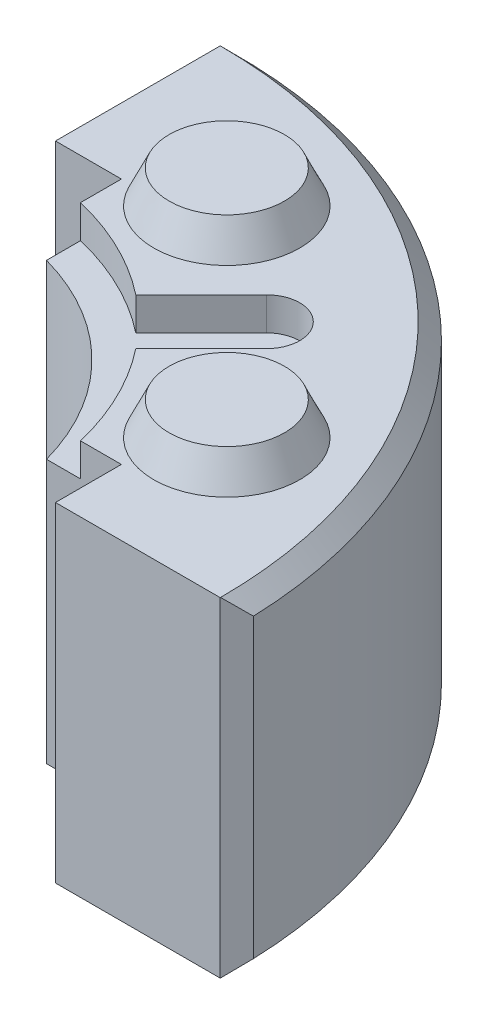
ISO-10303-21;
HEADER;
FILE_DESCRIPTION(('STEP AP214'),'2;1');
FILE_NAME('part.step','',(''),(''),'','','');
FILE_SCHEMA(('AUTOMOTIVE_DESIGN { 1 0 10303 214 1 1 1 1 }'));
ENDSEC;
DATA;
#1=APPLICATION_CONTEXT('core data for automotive mechanical design processes');
#2=APPLICATION_PROTOCOL_DEFINITION('international standard','automotive_design',2000,#1);
#3=PRODUCT_CONTEXT('',#1,'mechanical');
#4=PRODUCT('Part','Part','',(#3));
#5=PRODUCT_RELATED_PRODUCT_CATEGORY('part','',(#4));
#6=PRODUCT_DEFINITION_FORMATION('','',#4);
#7=PRODUCT_DEFINITION_CONTEXT('part definition',#1,'design');
#8=PRODUCT_DEFINITION('design','',#6,#7);
#9=PRODUCT_DEFINITION_SHAPE('','',#8);
#10=(LENGTH_UNIT() NAMED_UNIT(*) SI_UNIT(.MILLI.,.METRE.));
#11=(NAMED_UNIT(*) PLANE_ANGLE_UNIT() SI_UNIT($,.RADIAN.));
#12=(NAMED_UNIT(*) SI_UNIT($,.STERADIAN.) SOLID_ANGLE_UNIT());
#13=UNCERTAINTY_MEASURE_WITH_UNIT(LENGTH_MEASURE(1.E-05),#10,'distance_accuracy_value','');
#14=(GEOMETRIC_REPRESENTATION_CONTEXT(3) GLOBAL_UNCERTAINTY_ASSIGNED_CONTEXT((#13)) GLOBAL_UNIT_ASSIGNED_CONTEXT((#10,
#11,#12)) REPRESENTATION_CONTEXT('',''));
#15=CARTESIAN_POINT('',(0.,0.,0.));
#16=DIRECTION('',(0.,0.,1.));
#17=DIRECTION('',(1.,0.,0.));
#18=AXIS2_PLACEMENT_3D('',#15,#16,#17);
#19=CARTESIAN_POINT('',(0.,10.,0.));
#20=DIRECTION('',(0.,-1.,0.));
#21=DIRECTION('',(0.,0.,-1.));
#22=AXIS2_PLACEMENT_3D('',#19,#20,#21);
#23=CYLINDRICAL_SURFACE('',#22,85.);
#24=CARTESIAN_POINT('',(0.,10.,0.));
#25=DIRECTION('',(0.,-1.,0.));
#26=DIRECTION('',(0.,0.,-1.));
#27=AXIS2_PLACEMENT_3D('',#24,#25,#26);
#28=CIRCLE('',#27,85.);
#29=CARTESIAN_POINT('',(66.7577497434309,10.,-52.6156141197026));
#30=VERTEX_POINT('',#29);
#31=CARTESIAN_POINT('',(82.6135582092915,10.,-20.0000000000003));
#32=VERTEX_POINT('',#31);
#33=EDGE_CURVE('E222',#30,#32,#28,.T.);
#34=ORIENTED_EDGE('',*,*,#33,.F.);
#35=DIRECTION('',(0.,-1.,0.));
#36=VECTOR('',#35,1.);
#37=CARTESIAN_POINT('',(66.7577497434309,10.,-52.6156141197026));
#38=LINE('',#37,#36);
#39=CARTESIAN_POINT('',(66.7577497434309,0.,-52.6156141197026));
#40=VERTEX_POINT('',#39);
#41=EDGE_CURVE('E712',#30,#40,#38,.T.);
#42=ORIENTED_EDGE('',*,*,#41,.T.);
#43=CARTESIAN_POINT('',(0.,0.,0.));
#44=DIRECTION('',(0.,-1.,0.));
#45=DIRECTION('',(0.,0.,-1.));
#46=AXIS2_PLACEMENT_3D('',#43,#44,#45);
#47=CIRCLE('',#46,85.);
#48=CARTESIAN_POINT('',(82.6135582092915,0.,-20.0000000000003));
#49=VERTEX_POINT('',#48);
#50=EDGE_CURVE('E230',#40,#49,#47,.T.);
#51=ORIENTED_EDGE('',*,*,#50,.T.);
#52=DIRECTION('',(0.,-1.,0.));
#53=VECTOR('',#52,1.);
#54=CARTESIAN_POINT('',(82.6135582092915,10.,-20.0000000000003));
#55=LINE('',#54,#53);
#56=EDGE_CURVE('E233',#32,#49,#55,.T.);
#57=ORIENTED_EDGE('',*,*,#56,.F.);
#58=EDGE_LOOP('',(#34,#42,#51,#57));
#59=FACE_BOUND('',#58,.T.);
#60=ADVANCED_FACE('F35',(#59),#23,.F.);
#61=CARTESIAN_POINT('',(0.,90.,0.));
#62=DIRECTION('',(0.,1.,0.));
#63=DIRECTION('',(0.,0.,1.));
#64=AXIS2_PLACEMENT_3D('',#61,#62,#63);
#65=CYLINDRICAL_SURFACE('',#64,85.);
#66=CARTESIAN_POINT('',(0.,100.,0.));
#67=DIRECTION('',(0.,1.,0.));
#68=DIRECTION('',(0.,0.,1.));
#69=AXIS2_PLACEMENT_3D('',#66,#67,#68);
#70=CIRCLE('',#69,85.);
#71=CARTESIAN_POINT('',(82.6135582092915,100.,-20.0000000000003));
#72=VERTEX_POINT('',#71);
#73=CARTESIAN_POINT('',(66.7577497434309,100.,-52.6156141197026));
#74=VERTEX_POINT('',#73);
#75=EDGE_CURVE('E242',#72,#74,#70,.T.);
#76=ORIENTED_EDGE('',*,*,#75,.T.);
#77=DIRECTION('',(0.,1.,0.));
#78=VECTOR('',#77,1.);
#79=CARTESIAN_POINT('',(66.7577497434309,90.,-52.6156141197026));
#80=LINE('',#79,#78);
#81=CARTESIAN_POINT('',(66.7577497434309,90.,-52.6156141197026));
#82=VERTEX_POINT('',#81);
#83=EDGE_CURVE('E732',#82,#74,#80,.T.);
#84=ORIENTED_EDGE('',*,*,#83,.F.);
#85=CARTESIAN_POINT('',(0.,90.,0.));
#86=DIRECTION('',(0.,1.,0.));
#87=DIRECTION('',(0.,0.,1.));
#88=AXIS2_PLACEMENT_3D('',#85,#86,#87);
#89=CIRCLE('',#88,85.);
#90=CARTESIAN_POINT('',(82.6135582092915,90.,-20.0000000000003));
#91=VERTEX_POINT('',#90);
#92=EDGE_CURVE('E237',#91,#82,#89,.T.);
#93=ORIENTED_EDGE('',*,*,#92,.F.);
#94=DIRECTION('',(0.,1.,0.));
#95=VECTOR('',#94,1.);
#96=CARTESIAN_POINT('',(82.6135582092915,90.,-20.0000000000003));
#97=LINE('',#96,#95);
#98=EDGE_CURVE('E249',#72,#91,#97,.F.);
#99=ORIENTED_EDGE('',*,*,#98,.F.);
#100=EDGE_LOOP('',(#76,#84,#93,#99));
#101=FACE_BOUND('',#100,.T.);
#102=ADVANCED_FACE('F462',(#101),#65,.F.);
#103=CARTESIAN_POINT('',(0.,100.,0.));
#104=DIRECTION('',(0.,-1.,0.));
#105=DIRECTION('',(0.,0.,-1.));
#106=AXIS2_PLACEMENT_3D('',#103,#104,#105);
#107=CYLINDRICAL_SURFACE('',#106,75.);
#108=CARTESIAN_POINT('',(0.,9.99999999999999,0.));
#109=DIRECTION('',(0.,-1.,0.));
#110=DIRECTION('',(0.,0.,-1.));
#111=AXIS2_PLACEMENT_3D('',#108,#109,#110);
#112=CIRCLE('',#111,75.);
#113=CARTESIAN_POINT('',(72.2841614740047,9.99999999999999,-20.0000000000002));
#114=VERTEX_POINT('',#113);
#115=CARTESIAN_POINT('',(20.,10.,-72.2841614740048));
#116=VERTEX_POINT('',#115);
#117=EDGE_CURVE('E221',#114,#116,#112,.F.);
#118=ORIENTED_EDGE('',*,*,#117,.F.);
#119=DIRECTION('',(0.,-1.,0.));
#120=VECTOR('',#119,1.);
#121=CARTESIAN_POINT('',(72.2841614740047,100.,-20.0000000000002));
#122=LINE('',#121,#120);
#123=CARTESIAN_POINT('',(72.2841614740047,90.,-20.0000000000002));
#124=VERTEX_POINT('',#123);
#125=EDGE_CURVE('E266',#114,#124,#122,.F.);
#126=ORIENTED_EDGE('',*,*,#125,.T.);
#127=CARTESIAN_POINT('',(0.,90.,0.));
#128=DIRECTION('',(0.,1.,0.));
#129=DIRECTION('',(0.,0.,1.));
#130=AXIS2_PLACEMENT_3D('',#127,#128,#129);
#131=CIRCLE('',#130,75.);
#132=CARTESIAN_POINT('',(20.,90.,-72.2841614740048));
#133=VERTEX_POINT('',#132);
#134=EDGE_CURVE('E240',#133,#124,#131,.F.);
#135=ORIENTED_EDGE('',*,*,#134,.F.);
#136=DIRECTION('',(0.,-1.,0.));
#137=VECTOR('',#136,1.);
#138=CARTESIAN_POINT('',(20.,100.,-72.2841614740048));
#139=LINE('',#138,#137);
#140=EDGE_CURVE('E281',#133,#116,#139,.T.);
#141=ORIENTED_EDGE('',*,*,#140,.T.);
#142=EDGE_LOOP('',(#118,#126,#135,#141));
#143=FACE_BOUND('',#142,.T.);
#144=ADVANCED_FACE('F456',(#143),#107,.F.);
#145=CARTESIAN_POINT('',(0.,100.,0.));
#146=DIRECTION('',(0.,-1.,0.));
#147=DIRECTION('',(0.,0.,-1.));
#148=AXIS2_PLACEMENT_3D('',#145,#146,#147);
#149=CYLINDRICAL_SURFACE('',#148,150.);
#150=CARTESIAN_POINT('',(0.,95.,0.));
#151=DIRECTION('',(0.,1.,0.));
#152=DIRECTION('',(0.,0.,1.));
#153=AXIS2_PLACEMENT_3D('',#150,#151,#152);
#154=CIRCLE('',#153,150.);
#155=CARTESIAN_POINT('',(5.17241379310346,95.,-149.910793926098));
#156=VERTEX_POINT('',#155);
#157=CARTESIAN_POINT('',(149.910793926098,95.,-5.17241379310346));
#158=VERTEX_POINT('',#157);
#159=EDGE_CURVE('E328',#156,#158,#154,.F.);
#160=ORIENTED_EDGE('',*,*,#159,.T.);
#161=DIRECTION('',(0.,-1.,0.));
#162=VECTOR('',#161,1.);
#163=CARTESIAN_POINT('',(149.910793926098,100.,-5.17241379310346));
#164=LINE('',#163,#162);
#165=CARTESIAN_POINT('',(149.910793926098,5.,-5.17241379310346));
#166=VERTEX_POINT('',#165);
#167=EDGE_CURVE('E330',#158,#166,#164,.T.);
#168=ORIENTED_EDGE('',*,*,#167,.T.);
#169=CARTESIAN_POINT('',(0.,5.,0.));
#170=DIRECTION('',(0.,1.,0.));
#171=DIRECTION('',(0.,0.,1.));
#172=AXIS2_PLACEMENT_3D('',#169,#170,#171);
#173=CIRCLE('',#172,150.);
#174=CARTESIAN_POINT('',(5.17241379310346,5.,-149.910793926098));
#175=VERTEX_POINT('',#174);
#176=EDGE_CURVE('E324',#166,#175,#173,.T.);
#177=ORIENTED_EDGE('',*,*,#176,.T.);
#178=DIRECTION('',(0.,-1.,0.));
#179=VECTOR('',#178,1.);
#180=CARTESIAN_POINT('',(5.17241379310346,100.,-149.910793926098));
#181=LINE('',#180,#179);
#182=EDGE_CURVE('E326',#175,#156,#181,.F.);
#183=ORIENTED_EDGE('',*,*,#182,.T.);
#184=EDGE_LOOP('',(#160,#168,#177,#183));
#185=FACE_BOUND('',#184,.T.);
#186=ADVANCED_FACE('F454',(#185),#149,.T.);
#187=CARTESIAN_POINT('',(0.,100.,-150.));
#188=DIRECTION('',(1.,0.,0.));
#189=DIRECTION('',(0.,0.,-1.));
#190=AXIS2_PLACEMENT_3D('',#187,#188,#189);
#191=PLANE('',#190);
#192=DIRECTION('',(0.,0.,1.));
#193=VECTOR('',#192,1.);
#194=CARTESIAN_POINT('',(0.,100.,-150.));
#195=LINE('',#194,#193);
#196=CARTESIAN_POINT('',(0.,100.,-144.913767461894));
#197=VERTEX_POINT('',#196);
#198=CARTESIAN_POINT('',(0.,100.,-95.));
#199=VERTEX_POINT('',#198);
#200=EDGE_CURVE('E303',#197,#199,#195,.T.);
#201=ORIENTED_EDGE('',*,*,#200,.F.);
#202=DIRECTION('',(0.,-1.,0.));
#203=VECTOR('',#202,1.);
#204=CARTESIAN_POINT('',(0.,100.,-144.913767461894));
#205=LINE('',#204,#203);
#206=CARTESIAN_POINT('',(0.,0.,-144.913767461894));
#207=VERTEX_POINT('',#206);
#208=EDGE_CURVE('E348',#197,#207,#205,.T.);
#209=ORIENTED_EDGE('',*,*,#208,.T.);
#210=DIRECTION('',(0.,0.,1.));
#211=VECTOR('',#210,1.);
#212=CARTESIAN_POINT('',(0.,0.,-150.));
#213=LINE('',#212,#211);
#214=CARTESIAN_POINT('',(0.,0.,-95.));
#215=VERTEX_POINT('',#214);
#216=EDGE_CURVE('E302',#207,#215,#213,.T.);
#217=ORIENTED_EDGE('',*,*,#216,.T.);
#218=DIRECTION('',(0.,1.,0.));
#219=VECTOR('',#218,1.);
#220=CARTESIAN_POINT('',(0.,100.,-95.));
#221=LINE('',#220,#219);
#222=EDGE_CURVE('E276',#215,#199,#221,.T.);
#223=ORIENTED_EDGE('',*,*,#222,.T.);
#224=EDGE_LOOP('',(#201,#209,#217,#223));
#225=FACE_BOUND('',#224,.T.);
#226=ADVANCED_FACE('F422',(#225),#191,.F.);
#227=CARTESIAN_POINT('',(75.,100.,0.));
#228=DIRECTION('',(0.,0.,-1.));
#229=DIRECTION('',(-1.,0.,0.));
#230=AXIS2_PLACEMENT_3D('',#227,#228,#229);
#231=PLANE('',#230);
#232=DIRECTION('',(1.,0.,0.));
#233=VECTOR('',#232,1.);
#234=CARTESIAN_POINT('',(75.,0.,0.));
#235=LINE('',#234,#233);
#236=CARTESIAN_POINT('',(95.,0.,0.));
#237=VERTEX_POINT('',#236);
#238=CARTESIAN_POINT('',(144.913767461894,0.,0.));
#239=VERTEX_POINT('',#238);
#240=EDGE_CURVE('E306',#237,#239,#235,.T.);
#241=ORIENTED_EDGE('',*,*,#240,.T.);
#242=DIRECTION('',(0.,1.,0.));
#243=VECTOR('',#242,1.);
#244=CARTESIAN_POINT('',(144.913767461894,100.,0.));
#245=LINE('',#244,#243);
#246=CARTESIAN_POINT('',(144.913767461894,100.,0.));
#247=VERTEX_POINT('',#246);
#248=EDGE_CURVE('E339',#239,#247,#245,.T.);
#249=ORIENTED_EDGE('',*,*,#248,.T.);
#250=DIRECTION('',(1.,0.,0.));
#251=VECTOR('',#250,1.);
#252=CARTESIAN_POINT('',(75.,100.,0.));
#253=LINE('',#252,#251);
#254=CARTESIAN_POINT('',(95.,100.,0.));
#255=VERTEX_POINT('',#254);
#256=EDGE_CURVE('E305',#255,#247,#253,.T.);
#257=ORIENTED_EDGE('',*,*,#256,.F.);
#258=DIRECTION('',(0.,-1.,0.));
#259=VECTOR('',#258,1.);
#260=CARTESIAN_POINT('',(95.,100.,0.));
#261=LINE('',#260,#259);
#262=EDGE_CURVE('E270',#255,#237,#261,.T.);
#263=ORIENTED_EDGE('',*,*,#262,.T.);
#264=EDGE_LOOP('',(#241,#249,#257,#263));
#265=FACE_BOUND('',#264,.T.);
#266=ADVANCED_FACE('F445',(#265),#231,.F.);
#267=CARTESIAN_POINT('',(0.,100.,0.));
#268=DIRECTION('',(0.,1.,0.));
#269=DIRECTION('',(0.,0.,1.));
#270=AXIS2_PLACEMENT_3D('',#267,#268,#269);
#271=PLANE('',#270);
#272=DIRECTION('',(0.707106781186735,0.,-0.70710678118636));
#273=VECTOR('',#272,1.);
#274=CARTESIAN_POINT('',(66.7577497434309,100.,-52.6156141197026));
#275=LINE('',#274,#273);
#276=CARTESIAN_POINT('',(86.6205806953541,100.,-72.4784450716153));
#277=VERTEX_POINT('',#276);
#278=EDGE_CURVE('E719',#74,#277,#275,.T.);
#279=ORIENTED_EDGE('',*,*,#278,.F.);
#280=ORIENTED_EDGE('',*,*,#75,.F.);
#281=DIRECTION('',(-1.,0.,0.));
#282=VECTOR('',#281,1.);
#283=CARTESIAN_POINT('',(0.,100.,-20.));
#284=LINE('',#283,#282);
#285=CARTESIAN_POINT('',(94.9999999999999,100.,-20.0000000000003));
#286=VERTEX_POINT('',#285);
#287=EDGE_CURVE('E259',#286,#72,#284,.T.);
#288=ORIENTED_EDGE('',*,*,#287,.F.);
#289=DIRECTION('',(0.,0.,-1.));
#290=VECTOR('',#289,1.);
#291=CARTESIAN_POINT('',(95.,100.,-3.29597460435593E-13));
#292=LINE('',#291,#290);
#293=EDGE_CURVE('E268',#255,#286,#292,.T.);
#294=ORIENTED_EDGE('',*,*,#293,.F.);
#295=ORIENTED_EDGE('',*,*,#256,.T.);
#296=DIRECTION('',(-0.694808333779654,0.,0.719194952228073));
#297=VECTOR('',#296,1.);
#298=CARTESIAN_POINT('',(74.9553969630482,100.,72.4137931034483));
#299=LINE('',#298,#297);
#300=CARTESIAN_POINT('',(144.999972544395,100.,-0.0892307377114085));
#301=VERTEX_POINT('',#300);
#302=EDGE_CURVE('E346',#247,#301,#299,.F.);
#303=ORIENTED_EDGE('',*,*,#302,.T.);
#304=CARTESIAN_POINT('',(0.,100.,0.));
#305=DIRECTION('',(0.,1.,0.));
#306=DIRECTION('',(0.,0.,1.));
#307=AXIS2_PLACEMENT_3D('',#304,#305,#306);
#308=CIRCLE('',#307,145.);
#309=CARTESIAN_POINT('',(0.0892307377114092,100.,-144.999972544395));
#310=VERTEX_POINT('',#309);
#311=EDGE_CURVE('E344',#301,#310,#308,.T.);
#312=ORIENTED_EDGE('',*,*,#311,.T.);
#313=DIRECTION('',(0.719194952228073,0.,-0.694808333779654));
#314=VECTOR('',#313,1.);
#315=CARTESIAN_POINT('',(-72.4137931034483,100.,-74.9553969630482));
#316=LINE('',#315,#314);
#317=EDGE_CURVE('E342',#310,#197,#316,.F.);
#318=ORIENTED_EDGE('',*,*,#317,.T.);
#319=ORIENTED_EDGE('',*,*,#200,.T.);
#320=DIRECTION('',(-1.,0.,0.));
#321=VECTOR('',#320,1.);
#322=CARTESIAN_POINT('',(0.,100.,-95.));
#323=LINE('',#322,#321);
#324=CARTESIAN_POINT('',(20.,100.,-95.));
#325=VERTEX_POINT('',#324);
#326=EDGE_CURVE('E273',#325,#199,#323,.T.);
#327=ORIENTED_EDGE('',*,*,#326,.F.);
#328=DIRECTION('',(0.,0.,-1.));
#329=VECTOR('',#328,1.);
#330=CARTESIAN_POINT('',(20.,100.,0.));
#331=LINE('',#330,#329);
#332=CARTESIAN_POINT('',(20.,100.,-82.6135582092916));
#333=VERTEX_POINT('',#332);
#334=EDGE_CURVE('E279',#333,#325,#331,.T.);
#335=ORIENTED_EDGE('',*,*,#334,.F.);
#336=CARTESIAN_POINT('',(52.6156141197026,100.,-66.757749743431));
#337=VERTEX_POINT('',#336);
#338=EDGE_CURVE('E236',#337,#333,#70,.T.);
#339=ORIENTED_EDGE('',*,*,#338,.F.);
#340=DIRECTION('',(-0.707106781186735,0.,0.707106781186361));
#341=VECTOR('',#340,1.);
#342=CARTESIAN_POINT('',(52.6156141197026,100.,-66.757749743431));
#343=LINE('',#342,#341);
#344=CARTESIAN_POINT('',(72.4784450716277,100.,-86.6205806953455));
#345=VERTEX_POINT('',#344);
#346=EDGE_CURVE('E726',#345,#337,#343,.T.);
#347=ORIENTED_EDGE('',*,*,#346,.F.);
#348=CARTESIAN_POINT('',(79.5495128834868,100.,-79.5495128834864));
#349=DIRECTION('',(0.,1.,0.));
#350=DIRECTION('',(0.,0.,1.));
#351=AXIS2_PLACEMENT_3D('',#348,#349,#350);
#352=CIRCLE('',#351,9.99999999999815);
#353=EDGE_CURVE('E714',#277,#345,#352,.T.);
#354=ORIENTED_EDGE('',*,*,#353,.F.);
#355=EDGE_LOOP('',(#279,#280,#288,#294,#295,#303,#312,#318,#319,#327,#335,#339,#347,#354));
#356=FACE_BOUND('',#355,.T.);
#357=CARTESIAN_POINT('',(103.936447407522,100.,-43.0518861410683));
#358=DIRECTION('',(0.,1.,0.));
#359=DIRECTION('',(0.,0.,1.));
#360=AXIS2_PLACEMENT_3D('',#357,#358,#359);
#361=CIRCLE('',#360,22.16307658155);
#362=CARTESIAN_POINT('',(103.936447407522,100.,-20.8888095595183));
#363=VERTEX_POINT('',#362);
#364=EDGE_CURVE('E315',#363,#363,#361,.T.);
#365=ORIENTED_EDGE('',*,*,#364,.F.);
#366=EDGE_LOOP('',(#365));
#367=FACE_BOUND('',#366,.T.);
#368=CARTESIAN_POINT('',(43.0518861410727,100.,-103.93644740752));
#369=DIRECTION('',(0.,1.,0.));
#370=DIRECTION('',(0.,0.,1.));
#371=AXIS2_PLACEMENT_3D('',#368,#369,#370);
#372=CIRCLE('',#371,22.16307658155);
#373=CARTESIAN_POINT('',(43.0518861410727,100.,-81.7733708259697));
#374=VERTEX_POINT('',#373);
#375=EDGE_CURVE('E309',#374,#374,#372,.T.);
#376=ORIENTED_EDGE('',*,*,#375,.F.);
#377=EDGE_LOOP('',(#376));
#378=FACE_BOUND('',#377,.T.);
#379=ADVANCED_FACE('F413',(#356,#367,#378),#271,.T.);
#380=CARTESIAN_POINT('',(0.,0.,0.));
#381=DIRECTION('',(0.,1.,0.));
#382=DIRECTION('',(0.,0.,1.));
#383=AXIS2_PLACEMENT_3D('',#380,#381,#382);
#384=PLANE('',#383);
#385=CARTESIAN_POINT('',(103.93644740752,0.,-43.0518861410727));
#386=DIRECTION('',(0.,-1.,0.));
#387=DIRECTION('',(0.,0.,-1.));
#388=AXIS2_PLACEMENT_3D('',#385,#386,#387);
#389=CIRCLE('',#388,18.);
#390=CARTESIAN_POINT('',(103.93644740752,0.,-61.0518861410727));
#391=VERTEX_POINT('',#390);
#392=EDGE_CURVE('E285',#391,#391,#389,.T.);
#393=ORIENTED_EDGE('',*,*,#392,.F.);
#394=EDGE_LOOP('',(#393));
#395=FACE_BOUND('',#394,.T.);
#396=CARTESIAN_POINT('',(43.0518861410723,0.,-103.93644740752));
#397=DIRECTION('',(0.,-1.,0.));
#398=DIRECTION('',(0.,0.,-1.));
#399=AXIS2_PLACEMENT_3D('',#396,#397,#398);
#400=CIRCLE('',#399,18.);
#401=CARTESIAN_POINT('',(43.0518861410723,0.,-121.93644740752));
#402=VERTEX_POINT('',#401);
#403=EDGE_CURVE('E284',#402,#402,#400,.T.);
#404=ORIENTED_EDGE('',*,*,#403,.F.);
#405=EDGE_LOOP('',(#404));
#406=FACE_BOUND('',#405,.T.);
#407=ORIENTED_EDGE('',*,*,#50,.F.);
#408=DIRECTION('',(-0.707106781186735,0.,0.70710678118636));
#409=VECTOR('',#408,1.);
#410=CARTESIAN_POINT('',(86.6205806953541,0.,-72.4784450716153));
#411=LINE('',#410,#409);
#412=CARTESIAN_POINT('',(86.6205806953541,0.,-72.4784450716153));
#413=VERTEX_POINT('',#412);
#414=EDGE_CURVE('E209',#413,#40,#411,.T.);
#415=ORIENTED_EDGE('',*,*,#414,.F.);
#416=CARTESIAN_POINT('',(79.5495128834868,0.,-79.5495128834864));
#417=DIRECTION('',(0.,-1.,0.));
#418=DIRECTION('',(0.,0.,-1.));
#419=AXIS2_PLACEMENT_3D('',#416,#417,#418);
#420=CIRCLE('',#419,10.0000000000035);
#421=CARTESIAN_POINT('',(72.4784450716188,0.,-86.6205806953543));
#422=VERTEX_POINT('',#421);
#423=EDGE_CURVE('E703',#422,#413,#420,.T.);
#424=ORIENTED_EDGE('',*,*,#423,.F.);
#425=DIRECTION('',(0.707106781186465,0.,-0.70710678118663));
#426=VECTOR('',#425,1.);
#427=CARTESIAN_POINT('',(52.6156141197026,0.,-66.757749743431));
#428=LINE('',#427,#426);
#429=CARTESIAN_POINT('',(52.6156141197026,0.,-66.757749743431));
#430=VERTEX_POINT('',#429);
#431=EDGE_CURVE('E706',#430,#422,#428,.T.);
#432=ORIENTED_EDGE('',*,*,#431,.F.);
#433=CARTESIAN_POINT('',(20.,0.,-82.6135582092916));
#434=VERTEX_POINT('',#433);
#435=EDGE_CURVE('E217',#434,#430,#47,.T.);
#436=ORIENTED_EDGE('',*,*,#435,.F.);
#437=DIRECTION('',(0.,0.,1.));
#438=VECTOR('',#437,1.);
#439=CARTESIAN_POINT('',(20.,0.,-55.));
#440=LINE('',#439,#438);
#441=CARTESIAN_POINT('',(20.,0.,-95.));
#442=VERTEX_POINT('',#441);
#443=EDGE_CURVE('E253',#442,#434,#440,.T.);
#444=ORIENTED_EDGE('',*,*,#443,.F.);
#445=DIRECTION('',(-1.,0.,0.));
#446=VECTOR('',#445,1.);
#447=CARTESIAN_POINT('',(0.,0.,-95.));
#448=LINE('',#447,#446);
#449=EDGE_CURVE('E321',#442,#215,#448,.T.);
#450=ORIENTED_EDGE('',*,*,#449,.T.);
#451=ORIENTED_EDGE('',*,*,#216,.F.);
#452=DIRECTION('',(-0.719194952228073,0.,0.694808333779654));
#453=VECTOR('',#452,1.);
#454=CARTESIAN_POINT('',(0.,0.,-144.913767461894));
#455=LINE('',#454,#453);
#456=CARTESIAN_POINT('',(0.0892307377114092,0.,-144.999972544395));
#457=VERTEX_POINT('',#456);
#458=EDGE_CURVE('E335',#207,#457,#455,.F.);
#459=ORIENTED_EDGE('',*,*,#458,.T.);
#460=CARTESIAN_POINT('',(0.,0.,0.));
#461=DIRECTION('',(0.,1.,0.));
#462=DIRECTION('',(0.,0.,1.));
#463=AXIS2_PLACEMENT_3D('',#460,#461,#462);
#464=CIRCLE('',#463,145.);
#465=CARTESIAN_POINT('',(144.999972544395,0.,-0.0892307377114085));
#466=VERTEX_POINT('',#465);
#467=EDGE_CURVE('E333',#457,#466,#464,.F.);
#468=ORIENTED_EDGE('',*,*,#467,.T.);
#469=DIRECTION('',(0.694808333779654,0.,-0.719194952228073));
#470=VECTOR('',#469,1.);
#471=CARTESIAN_POINT('',(149.910793926098,0.,-5.17241379310346));
#472=LINE('',#471,#470);
#473=EDGE_CURVE('E337',#466,#239,#472,.F.);
#474=ORIENTED_EDGE('',*,*,#473,.T.);
#475=ORIENTED_EDGE('',*,*,#240,.F.);
#476=DIRECTION('',(0.,0.,1.));
#477=VECTOR('',#476,1.);
#478=CARTESIAN_POINT('',(95.0000000000001,0.,19.9999999999997));
#479=LINE('',#478,#477);
#480=CARTESIAN_POINT('',(94.9999999999999,0.,-20.0000000000003));
#481=VERTEX_POINT('',#480);
#482=EDGE_CURVE('E260',#481,#237,#479,.T.);
#483=ORIENTED_EDGE('',*,*,#482,.F.);
#484=DIRECTION('',(-1.,0.,0.));
#485=VECTOR('',#484,1.);
#486=CARTESIAN_POINT('',(0.,0.,-20.));
#487=LINE('',#486,#485);
#488=EDGE_CURVE('E318',#481,#49,#487,.T.);
#489=ORIENTED_EDGE('',*,*,#488,.T.);
#490=EDGE_LOOP('',(#407,#415,#424,#432,#436,#444,#450,#451,#459,#468,#474,#475,#483,#489));
#491=FACE_BOUND('',#490,.T.);
#492=ADVANCED_FACE('F428',(#395,#406,#491),#384,.F.);
#493=CARTESIAN_POINT('',(43.0518861410727,110.,-103.93644740752));
#494=DIRECTION('',(0.,-1.,0.));
#495=DIRECTION('',(0.,0.,1.));
#496=AXIS2_PLACEMENT_3D('',#493,#494,#495);
#497=CONICAL_SURFACE('',#496,17.5,0.436332312998583);
#498=ORIENTED_EDGE('',*,*,#375,.T.);
#499=EDGE_LOOP('',(#498));
#500=FACE_BOUND('',#499,.T.);
#501=CARTESIAN_POINT('',(43.0518861410727,110.,-103.93644740752));
#502=DIRECTION('',(0.,1.,0.));
#503=DIRECTION('',(0.,0.,1.));
#504=AXIS2_PLACEMENT_3D('',#501,#502,#503);
#505=CIRCLE('',#504,17.5);
#506=CARTESIAN_POINT('',(43.0518861410727,110.,-86.4364474075197));
#507=VERTEX_POINT('',#506);
#508=EDGE_CURVE('E299',#507,#507,#505,.T.);
#509=ORIENTED_EDGE('',*,*,#508,.F.);
#510=EDGE_LOOP('',(#509));
#511=FACE_BOUND('',#510,.T.);
#512=ADVANCED_FACE('F526',(#500,#511),#497,.T.);
#513=CARTESIAN_POINT('',(43.0518861410727,110.,-103.93644740752));
#514=DIRECTION('',(0.,1.,0.));
#515=DIRECTION('',(0.,0.,1.));
#516=AXIS2_PLACEMENT_3D('',#513,#514,#515);
#517=PLANE('',#516);
#518=ORIENTED_EDGE('',*,*,#508,.T.);
#519=EDGE_LOOP('',(#518));
#520=FACE_BOUND('',#519,.T.);
#521=ADVANCED_FACE('F522',(#520),#517,.T.);
#522=CARTESIAN_POINT('',(103.936447407522,110.,-43.0518861410683));
#523=DIRECTION('',(0.,-1.,0.));
#524=DIRECTION('',(0.,0.,1.));
#525=AXIS2_PLACEMENT_3D('',#522,#523,#524);
#526=CONICAL_SURFACE('',#525,17.5,0.436332312998583);
#527=ORIENTED_EDGE('',*,*,#364,.T.);
#528=EDGE_LOOP('',(#527));
#529=FACE_BOUND('',#528,.T.);
#530=CARTESIAN_POINT('',(103.936447407522,110.,-43.0518861410683));
#531=DIRECTION('',(0.,1.,0.));
#532=DIRECTION('',(0.,0.,1.));
#533=AXIS2_PLACEMENT_3D('',#530,#531,#532);
#534=CIRCLE('',#533,17.5);
#535=CARTESIAN_POINT('',(103.936447407522,110.,-25.5518861410683));
#536=VERTEX_POINT('',#535);
#537=EDGE_CURVE('E292',#536,#536,#534,.T.);
#538=ORIENTED_EDGE('',*,*,#537,.F.);
#539=EDGE_LOOP('',(#538));
#540=FACE_BOUND('',#539,.T.);
#541=ADVANCED_FACE('F518',(#529,#540),#526,.T.);
#542=CARTESIAN_POINT('',(103.936447407522,110.,-43.0518861410683));
#543=DIRECTION('',(0.,1.,0.));
#544=DIRECTION('',(0.,0.,1.));
#545=AXIS2_PLACEMENT_3D('',#542,#543,#544);
#546=PLANE('',#545);
#547=ORIENTED_EDGE('',*,*,#537,.T.);
#548=EDGE_LOOP('',(#547));
#549=FACE_BOUND('',#548,.T.);
#550=ADVANCED_FACE('F514',(#549),#546,.T.);
#551=CARTESIAN_POINT('',(43.0518861410723,0.,-103.93644740752));
#552=DIRECTION('',(0.,-1.,0.));
#553=DIRECTION('',(0.,0.,-1.));
#554=AXIS2_PLACEMENT_3D('',#551,#552,#553);
#555=CONICAL_SURFACE('',#554,18.,0.436332312998583);
#556=CARTESIAN_POINT('',(43.0518861410723,11.,-103.93644740752));
#557=DIRECTION('',(0.,-1.,0.));
#558=DIRECTION('',(0.,0.,-1.));
#559=AXIS2_PLACEMENT_3D('',#556,#557,#558);
#560=CIRCLE('',#559,12.870615760295);
#561=CARTESIAN_POINT('',(43.0518861410723,11.,-116.807063167815));
#562=VERTEX_POINT('',#561);
#563=EDGE_CURVE('E289',#562,#562,#560,.T.);
#564=ORIENTED_EDGE('',*,*,#563,.F.);
#565=EDGE_LOOP('',(#564));
#566=FACE_BOUND('',#565,.T.);
#567=ORIENTED_EDGE('',*,*,#403,.T.);
#568=EDGE_LOOP('',(#567));
#569=FACE_BOUND('',#568,.T.);
#570=ADVANCED_FACE('F510',(#566,#569),#555,.F.);
#571=CARTESIAN_POINT('',(43.0518861410723,11.,-103.93644740752));
#572=DIRECTION('',(0.,-1.,0.));
#573=DIRECTION('',(0.,0.,-1.));
#574=AXIS2_PLACEMENT_3D('',#571,#572,#573);
#575=PLANE('',#574);
#576=ORIENTED_EDGE('',*,*,#563,.T.);
#577=EDGE_LOOP('',(#576));
#578=FACE_BOUND('',#577,.T.);
#579=ADVANCED_FACE('F506',(#578),#575,.T.);
#580=CARTESIAN_POINT('',(103.93644740752,0.,-43.0518861410727));
#581=DIRECTION('',(0.,-1.,0.));
#582=DIRECTION('',(0.,0.,-1.));
#583=AXIS2_PLACEMENT_3D('',#580,#581,#582);
#584=CONICAL_SURFACE('',#583,18.,0.436332312998583);
#585=CARTESIAN_POINT('',(103.93644740752,11.,-43.0518861410727));
#586=DIRECTION('',(0.,-1.,0.));
#587=DIRECTION('',(0.,0.,-1.));
#588=AXIS2_PLACEMENT_3D('',#585,#586,#587);
#589=CIRCLE('',#588,12.870615760295);
#590=CARTESIAN_POINT('',(103.93644740752,11.,-55.9225019013677));
#591=VERTEX_POINT('',#590);
#592=EDGE_CURVE('E288',#591,#591,#589,.T.);
#593=ORIENTED_EDGE('',*,*,#592,.F.);
#594=EDGE_LOOP('',(#593));
#595=FACE_BOUND('',#594,.T.);
#596=ORIENTED_EDGE('',*,*,#392,.T.);
#597=EDGE_LOOP('',(#596));
#598=FACE_BOUND('',#597,.T.);
#599=ADVANCED_FACE('F502',(#595,#598),#584,.F.);
#600=CARTESIAN_POINT('',(103.93644740752,11.,-43.0518861410727));
#601=DIRECTION('',(0.,-1.,0.));
#602=DIRECTION('',(0.,0.,-1.));
#603=AXIS2_PLACEMENT_3D('',#600,#601,#602);
#604=PLANE('',#603);
#605=ORIENTED_EDGE('',*,*,#592,.T.);
#606=EDGE_LOOP('',(#605));
#607=FACE_BOUND('',#606,.T.);
#608=ADVANCED_FACE('F495',(#607),#604,.T.);
#609=CARTESIAN_POINT('',(95.0000000000001,144.,19.9999999999997));
#610=DIRECTION('',(1.,0.,0.));
#611=DIRECTION('',(0.,0.,-1.));
#612=AXIS2_PLACEMENT_3D('',#609,#610,#611);
#613=PLANE('',#612);
#614=ORIENTED_EDGE('',*,*,#293,.T.);
#615=DIRECTION('',(0.,-1.,0.));
#616=VECTOR('',#615,1.);
#617=CARTESIAN_POINT('',(94.9999999999999,144.,-20.0000000000003));
#618=LINE('',#617,#616);
#619=EDGE_CURVE('E257',#286,#481,#618,.T.);
#620=ORIENTED_EDGE('',*,*,#619,.T.);
#621=ORIENTED_EDGE('',*,*,#482,.T.);
#622=ORIENTED_EDGE('',*,*,#262,.F.);
#623=EDGE_LOOP('',(#614,#620,#621,#622));
#624=FACE_BOUND('',#623,.T.);
#625=ADVANCED_FACE('F492',(#624),#613,.F.);
#626=CARTESIAN_POINT('',(54.9999999999999,144.,-20.0000000000002));
#627=DIRECTION('',(0.,0.,-1.));
#628=DIRECTION('',(-1.,0.,0.));
#629=AXIS2_PLACEMENT_3D('',#626,#627,#628);
#630=PLANE('',#629);
#631=DIRECTION('',(-1.,0.,0.));
#632=VECTOR('',#631,1.);
#633=CARTESIAN_POINT('',(54.9999999999999,10.,-20.0000000000002));
#634=LINE('',#633,#632);
#635=EDGE_CURVE('E224',#32,#114,#634,.T.);
#636=ORIENTED_EDGE('',*,*,#635,.F.);
#637=ORIENTED_EDGE('',*,*,#56,.T.);
#638=ORIENTED_EDGE('',*,*,#488,.F.);
#639=ORIENTED_EDGE('',*,*,#619,.F.);
#640=ORIENTED_EDGE('',*,*,#287,.T.);
#641=ORIENTED_EDGE('',*,*,#98,.T.);
#642=DIRECTION('',(1.,0.,0.));
#643=VECTOR('',#642,1.);
#644=CARTESIAN_POINT('',(54.9999999999999,90.,-20.0000000000002));
#645=LINE('',#644,#643);
#646=EDGE_CURVE('E247',#124,#91,#645,.T.);
#647=ORIENTED_EDGE('',*,*,#646,.F.);
#648=ORIENTED_EDGE('',*,*,#125,.F.);
#649=EDGE_LOOP('',(#636,#637,#638,#639,#640,#641,#647,#648));
#650=FACE_BOUND('',#649,.T.);
#651=ADVANCED_FACE('F491',(#650),#630,.F.);
#652=CARTESIAN_POINT('',(20.,144.,-55.));
#653=DIRECTION('',(1.,0.,0.));
#654=DIRECTION('',(0.,0.,-1.));
#655=AXIS2_PLACEMENT_3D('',#652,#653,#654);
#656=PLANE('',#655);
#657=ORIENTED_EDGE('',*,*,#443,.T.);
#658=DIRECTION('',(0.,-1.,0.));
#659=VECTOR('',#658,1.);
#660=CARTESIAN_POINT('',(20.,10.,-82.6135582092916));
#661=LINE('',#660,#659);
#662=CARTESIAN_POINT('',(20.,10.,-82.6135582092916));
#663=VERTEX_POINT('',#662);
#664=EDGE_CURVE('E11',#434,#663,#661,.F.);
#665=ORIENTED_EDGE('',*,*,#664,.T.);
#666=DIRECTION('',(0.,0.,-1.));
#667=VECTOR('',#666,1.);
#668=CARTESIAN_POINT('',(20.,10.,-55.));
#669=LINE('',#668,#667);
#670=EDGE_CURVE('E45',#116,#663,#669,.T.);
#671=ORIENTED_EDGE('',*,*,#670,.F.);
#672=ORIENTED_EDGE('',*,*,#140,.F.);
#673=DIRECTION('',(0.,0.,1.));
#674=VECTOR('',#673,1.);
#675=CARTESIAN_POINT('',(20.,90.,-55.));
#676=LINE('',#675,#674);
#677=CARTESIAN_POINT('',(20.,90.,-82.6135582092916));
#678=VERTEX_POINT('',#677);
#679=EDGE_CURVE('E350',#678,#133,#676,.T.);
#680=ORIENTED_EDGE('',*,*,#679,.F.);
#681=DIRECTION('',(0.,1.,0.));
#682=VECTOR('',#681,1.);
#683=CARTESIAN_POINT('',(20.,90.,-82.6135582092916));
#684=LINE('',#683,#682);
#685=EDGE_CURVE('E398',#678,#333,#684,.T.);
#686=ORIENTED_EDGE('',*,*,#685,.T.);
#687=ORIENTED_EDGE('',*,*,#334,.T.);
#688=DIRECTION('',(0.,-1.,0.));
#689=VECTOR('',#688,1.);
#690=CARTESIAN_POINT('',(20.,144.,-95.));
#691=LINE('',#690,#689);
#692=EDGE_CURVE('E256',#325,#442,#691,.T.);
#693=ORIENTED_EDGE('',*,*,#692,.T.);
#694=EDGE_LOOP('',(#657,#665,#671,#672,#680,#686,#687,#693));
#695=FACE_BOUND('',#694,.T.);
#696=ADVANCED_FACE('F404',(#695),#656,.F.);
#697=CARTESIAN_POINT('',(-20.,144.,-95.));
#698=DIRECTION('',(0.,0.,-1.));
#699=DIRECTION('',(-1.,0.,0.));
#700=AXIS2_PLACEMENT_3D('',#697,#698,#699);
#701=PLANE('',#700);
#702=ORIENTED_EDGE('',*,*,#449,.F.);
#703=ORIENTED_EDGE('',*,*,#692,.F.);
#704=ORIENTED_EDGE('',*,*,#326,.T.);
#705=ORIENTED_EDGE('',*,*,#222,.F.);
#706=EDGE_LOOP('',(#702,#703,#704,#705));
#707=FACE_BOUND('',#706,.T.);
#708=ADVANCED_FACE('F420',(#707),#701,.F.);
#709=CARTESIAN_POINT('',(0.,100.,-144.913767461894));
#710=DIRECTION('',(0.694808333779654,0.,0.719194952228073));
#711=DIRECTION('',(0.,-1.,0.));
#712=AXIS2_PLACEMENT_3D('',#709,#710,#711);
#713=PLANE('',#712);
#714=ORIENTED_EDGE('',*,*,#208,.F.);
#715=ORIENTED_EDGE('',*,*,#317,.F.);
#716=CARTESIAN_POINT('',(0.0892307377114092,100.,-144.999972544395));
#717=CARTESIAN_POINT('',(0.515268673138092,99.588145274396,-145.411564293091));
#718=CARTESIAN_POINT('',(0.940674760610717,99.1750276791582,-145.82254561867));
#719=CARTESIAN_POINT('',(1.79025100814391,98.3463625994438,-146.643314250512));
#720=CARTESIAN_POINT('',(2.21442118776061,97.9308151537319,-147.053101575667));
#721=CARTESIAN_POINT('',(3.06156659995706,97.0973734491137,-147.871521797463));
#722=CARTESIAN_POINT('',(3.48454183350303,96.6794791921058,-148.280154695038));
#723=CARTESIAN_POINT('',(4.3293374253895,95.8414201035903,-149.096304774741));
#724=CARTESIAN_POINT('',(4.75115776524869,95.4212552360633,-149.503821939015));
#725=CARTESIAN_POINT('',(5.17241379310345,95.,-149.910793926098));
#726=B_SPLINE_CURVE_WITH_KNOTS('',3,(#716,#717,#718,#719,#720,#721,#722,#723,#724,#725),
.UNSPECIFIED.,.F.,.F.,(4,2,2,2,4),(0.,2.16445230982759,4.32887018283876,6.4932863051953,
8.6577368637305),.UNSPECIFIED.);
#727=EDGE_CURVE('E262',#156,#310,#726,.F.);
#728=ORIENTED_EDGE('',*,*,#727,.F.);
#729=ORIENTED_EDGE('',*,*,#182,.F.);
#730=CARTESIAN_POINT('',(0.0892307377114092,0.,-144.999972544395));
#731=CARTESIAN_POINT('',(0.515268673138096,0.411854725603992,-145.411564293091));
#732=CARTESIAN_POINT('',(0.940674760610724,0.824972320841857,-145.82254561867));
#733=CARTESIAN_POINT('',(1.79025100814391,1.65363740055618,-146.643314250512));
#734=CARTESIAN_POINT('',(2.21442118776062,2.06918484626811,-147.053101575667));
#735=CARTESIAN_POINT('',(3.06156659995706,2.90262655088633,-147.871521797463));
#736=CARTESIAN_POINT('',(3.48454183350303,3.32052080789419,-148.280154695038));
#737=CARTESIAN_POINT('',(4.3293374253895,4.15857989640968,-149.096304774741));
#738=CARTESIAN_POINT('',(4.75115776524869,4.57874476393671,-149.503821939015));
#739=CARTESIAN_POINT('',(5.17241379310345,4.99999999999999,-149.910793926098));
#740=B_SPLINE_CURVE_WITH_KNOTS('',3,(#730,#731,#732,#733,#734,#735,#736,#737,#738,#739),
.UNSPECIFIED.,.F.,.F.,(4,2,2,2,4),(0.,2.1644523098276,4.32887018283876,6.49328630519531,
8.6577368637305),.UNSPECIFIED.);
#741=EDGE_CURVE('E392',#457,#175,#740,.T.);
#742=ORIENTED_EDGE('',*,*,#741,.F.);
#743=ORIENTED_EDGE('',*,*,#458,.F.);
#744=EDGE_LOOP('',(#714,#715,#728,#729,#742,#743));
#745=FACE_BOUND('',#744,.T.);
#746=ADVANCED_FACE('F38',(#745),#713,.F.);
#747=CARTESIAN_POINT('',(0.,100.,0.));
#748=DIRECTION('',(0.,-1.,0.));
#749=DIRECTION('',(0.,0.,-1.));
#750=AXIS2_PLACEMENT_3D('',#747,#748,#749);
#751=CONICAL_SURFACE('',#750,145.,0.785398163397454);
#752=ORIENTED_EDGE('',*,*,#727,.T.);
#753=ORIENTED_EDGE('',*,*,#311,.F.);
#754=CARTESIAN_POINT('',(144.999972544395,100.,-0.0892307377114085));
#755=CARTESIAN_POINT('',(145.411564293091,99.588145274396,-0.515268673138091));
#756=CARTESIAN_POINT('',(145.82254561867,99.1750276791582,-0.940674760610716));
#757=CARTESIAN_POINT('',(146.643314250512,98.3463625994438,-1.79025100814391));
#758=CARTESIAN_POINT('',(147.053101575667,97.9308151537319,-2.21442118776061));
#759=CARTESIAN_POINT('',(147.871521797463,97.0973734491137,-3.06156659995706));
#760=CARTESIAN_POINT('',(148.280154695038,96.6794791921058,-3.48454183350303));
#761=CARTESIAN_POINT('',(149.096304774741,95.8414201035903,-4.3293374253895));
#762=CARTESIAN_POINT('',(149.503821939015,95.4212552360633,-4.75115776524869));
#763=CARTESIAN_POINT('',(149.910793926098,95.,-5.17241379310345));
#764=B_SPLINE_CURVE_WITH_KNOTS('',3,(#754,#755,#756,#757,#758,#759,#760,#761,#762,#763),
.UNSPECIFIED.,.F.,.F.,(4,2,2,2,4),(0.,2.16445230982759,4.32887018283876,6.4932863051953,
8.6577368637305),.UNSPECIFIED.);
#765=EDGE_CURVE('E358',#158,#301,#764,.F.);
#766=ORIENTED_EDGE('',*,*,#765,.F.);
#767=ORIENTED_EDGE('',*,*,#159,.F.);
#768=EDGE_LOOP('',(#752,#753,#766,#767));
#769=FACE_BOUND('',#768,.T.);
#770=ADVANCED_FACE('F377',(#769),#751,.T.);
#771=CARTESIAN_POINT('',(0.,5.,0.));
#772=DIRECTION('',(0.,1.,0.));
#773=DIRECTION('',(0.,0.,1.));
#774=AXIS2_PLACEMENT_3D('',#771,#772,#773);
#775=CONICAL_SURFACE('',#774,150.,0.785398163397454);
#776=ORIENTED_EDGE('',*,*,#741,.T.);
#777=ORIENTED_EDGE('',*,*,#176,.F.);
#778=CARTESIAN_POINT('',(149.910793926098,5.,-5.17241379310346));
#779=CARTESIAN_POINT('',(149.503821939015,4.57874476393672,-4.7511577652487));
#780=CARTESIAN_POINT('',(149.096304774741,4.15857989640968,-4.32933742538951));
#781=CARTESIAN_POINT('',(148.280154695038,3.32052080789419,-3.48454183350304));
#782=CARTESIAN_POINT('',(147.871521797463,2.90262655088634,-3.06156659995706));
#783=CARTESIAN_POINT('',(147.053101575667,2.06918484626811,-2.21442118776061));
#784=CARTESIAN_POINT('',(146.643314250512,1.65363740055618,-1.79025100814391));
#785=CARTESIAN_POINT('',(145.82254561867,0.824972320841852,-0.940674760610721));
#786=CARTESIAN_POINT('',(145.411564293091,0.411854725603984,-0.515268673138095));
#787=CARTESIAN_POINT('',(144.999972544395,0.,-0.0892307377114095));
#788=B_SPLINE_CURVE_WITH_KNOTS('',3,(#778,#779,#780,#781,#782,#783,#784,#785,#786,#787),
.UNSPECIFIED.,.F.,.F.,(4,2,2,2,4),(0.,2.1644505585352,4.32886668089175,6.49328455390292,
8.65773686373052),.UNSPECIFIED.);
#789=EDGE_CURVE('E252',#466,#166,#788,.F.);
#790=ORIENTED_EDGE('',*,*,#789,.F.);
#791=ORIENTED_EDGE('',*,*,#467,.F.);
#792=EDGE_LOOP('',(#776,#777,#790,#791));
#793=FACE_BOUND('',#792,.T.);
#794=ADVANCED_FACE('F365',(#793),#775,.T.);
#795=CARTESIAN_POINT('',(149.910793926098,100.,-5.17241379310346));
#796=DIRECTION('',(-0.719194952228073,0.,-0.694808333779654));
#797=DIRECTION('',(0.,-1.,0.));
#798=AXIS2_PLACEMENT_3D('',#795,#796,#797);
#799=PLANE('',#798);
#800=ORIENTED_EDGE('',*,*,#302,.F.);
#801=ORIENTED_EDGE('',*,*,#248,.F.);
#802=ORIENTED_EDGE('',*,*,#473,.F.);
#803=ORIENTED_EDGE('',*,*,#789,.T.);
#804=ORIENTED_EDGE('',*,*,#167,.F.);
#805=ORIENTED_EDGE('',*,*,#765,.T.);
#806=EDGE_LOOP('',(#800,#801,#802,#803,#804,#805));
#807=FACE_BOUND('',#806,.T.);
#808=ADVANCED_FACE('F369',(#807),#799,.F.);
#809=CARTESIAN_POINT('',(52.6156141197026,90.,-66.7577497434309));
#810=VERTEX_POINT('',#809);
#811=EDGE_CURVE('E241',#810,#678,#89,.T.);
#812=ORIENTED_EDGE('',*,*,#811,.F.);
#813=DIRECTION('',(0.,1.,0.));
#814=VECTOR('',#813,1.);
#815=CARTESIAN_POINT('',(52.6156141197026,90.,-66.757749743431));
#816=LINE('',#815,#814);
#817=EDGE_CURVE('E733',#810,#337,#816,.T.);
#818=ORIENTED_EDGE('',*,*,#817,.T.);
#819=ORIENTED_EDGE('',*,*,#338,.T.);
#820=ORIENTED_EDGE('',*,*,#685,.F.);
#821=EDGE_LOOP('',(#812,#818,#819,#820));
#822=FACE_BOUND('',#821,.T.);
#823=ADVANCED_FACE('F375',(#822),#65,.F.);
#824=CARTESIAN_POINT('',(0.,90.,0.));
#825=DIRECTION('',(0.,1.,0.));
#826=DIRECTION('',(0.,0.,1.));
#827=AXIS2_PLACEMENT_3D('',#824,#825,#826);
#828=PLANE('',#827);
#829=ORIENTED_EDGE('',*,*,#646,.T.);
#830=ORIENTED_EDGE('',*,*,#92,.T.);
#831=DIRECTION('',(0.707106781186735,0.,-0.70710678118636));
#832=VECTOR('',#831,1.);
#833=CARTESIAN_POINT('',(66.7577497434309,90.,-52.6156141197026));
#834=LINE('',#833,#832);
#835=CARTESIAN_POINT('',(86.6205806953541,90.,-72.4784450716153));
#836=VERTEX_POINT('',#835);
#837=EDGE_CURVE('E721',#82,#836,#834,.T.);
#838=ORIENTED_EDGE('',*,*,#837,.T.);
#839=CARTESIAN_POINT('',(79.5495128834868,90.,-79.5495128834864));
#840=DIRECTION('',(0.,1.,0.));
#841=DIRECTION('',(0.,0.,1.));
#842=AXIS2_PLACEMENT_3D('',#839,#840,#841);
#843=CIRCLE('',#842,9.99999999999815);
#844=CARTESIAN_POINT('',(72.4784450716277,90.,-86.6205806953455));
#845=VERTEX_POINT('',#844);
#846=EDGE_CURVE('E717',#836,#845,#843,.T.);
#847=ORIENTED_EDGE('',*,*,#846,.T.);
#848=DIRECTION('',(-0.707106781186735,0.,0.707106781186361));
#849=VECTOR('',#848,1.);
#850=CARTESIAN_POINT('',(52.6156141197026,90.,-66.757749743431));
#851=LINE('',#850,#849);
#852=EDGE_CURVE('E60',#845,#810,#851,.T.);
#853=ORIENTED_EDGE('',*,*,#852,.T.);
#854=ORIENTED_EDGE('',*,*,#811,.T.);
#855=ORIENTED_EDGE('',*,*,#679,.T.);
#856=ORIENTED_EDGE('',*,*,#134,.T.);
#857=EDGE_LOOP('',(#829,#830,#838,#847,#853,#854,#855,#856));
#858=FACE_BOUND('',#857,.T.);
#859=ADVANCED_FACE('F477',(#858),#828,.T.);
#860=ORIENTED_EDGE('',*,*,#435,.T.);
#861=DIRECTION('',(0.,-1.,0.));
#862=VECTOR('',#861,1.);
#863=CARTESIAN_POINT('',(52.6156141197026,10.,-66.757749743431));
#864=LINE('',#863,#862);
#865=CARTESIAN_POINT('',(52.6156141197026,10.,-66.757749743431));
#866=VERTEX_POINT('',#865);
#867=EDGE_CURVE('E203',#866,#430,#864,.T.);
#868=ORIENTED_EDGE('',*,*,#867,.F.);
#869=EDGE_CURVE('E215',#663,#866,#28,.T.);
#870=ORIENTED_EDGE('',*,*,#869,.F.);
#871=ORIENTED_EDGE('',*,*,#664,.F.);
#872=EDGE_LOOP('',(#860,#868,#870,#871));
#873=FACE_BOUND('',#872,.T.);
#874=ADVANCED_FACE('F214',(#873),#23,.F.);
#875=CARTESIAN_POINT('',(0.,10.,0.));
#876=DIRECTION('',(0.,-1.,0.));
#877=DIRECTION('',(0.,0.,-1.));
#878=AXIS2_PLACEMENT_3D('',#875,#876,#877);
#879=PLANE('',#878);
#880=ORIENTED_EDGE('',*,*,#635,.T.);
#881=ORIENTED_EDGE('',*,*,#117,.T.);
#882=ORIENTED_EDGE('',*,*,#670,.T.);
#883=ORIENTED_EDGE('',*,*,#869,.T.);
#884=DIRECTION('',(0.707106781186465,0.,-0.70710678118663));
#885=VECTOR('',#884,1.);
#886=CARTESIAN_POINT('',(52.6156141197026,10.,-66.757749743431));
#887=LINE('',#886,#885);
#888=CARTESIAN_POINT('',(72.4784450716188,10.,-86.6205806953543));
#889=VERTEX_POINT('',#888);
#890=EDGE_CURVE('E199',#866,#889,#887,.T.);
#891=ORIENTED_EDGE('',*,*,#890,.T.);
#892=CARTESIAN_POINT('',(79.5495128834868,10.,-79.5495128834864));
#893=DIRECTION('',(0.,-1.,0.));
#894=DIRECTION('',(0.,0.,-1.));
#895=AXIS2_PLACEMENT_3D('',#892,#893,#894);
#896=CIRCLE('',#895,10.0000000000035);
#897=CARTESIAN_POINT('',(86.6205806953541,10.,-72.4784450716153));
#898=VERTEX_POINT('',#897);
#899=EDGE_CURVE('E208',#889,#898,#896,.T.);
#900=ORIENTED_EDGE('',*,*,#899,.T.);
#901=DIRECTION('',(-0.707106781186735,0.,0.70710678118636));
#902=VECTOR('',#901,1.);
#903=CARTESIAN_POINT('',(86.6205806953541,10.,-72.4784450716153));
#904=LINE('',#903,#902);
#905=EDGE_CURVE('E52',#898,#30,#904,.T.);
#906=ORIENTED_EDGE('',*,*,#905,.T.);
#907=ORIENTED_EDGE('',*,*,#33,.T.);
#908=EDGE_LOOP('',(#880,#881,#882,#883,#891,#900,#906,#907));
#909=FACE_BOUND('',#908,.T.);
#910=ADVANCED_FACE('F219',(#909),#879,.T.);
#911=CARTESIAN_POINT('',(79.5495128834868,90.,-79.5495128834864));
#912=DIRECTION('',(0.,1.,0.));
#913=DIRECTION('',(0.,0.,1.));
#914=AXIS2_PLACEMENT_3D('',#911,#912,#913);
#915=CYLINDRICAL_SURFACE('',#914,9.99999999999815);
#916=ORIENTED_EDGE('',*,*,#353,.T.);
#917=DIRECTION('',(0.,1.,0.));
#918=VECTOR('',#917,1.);
#919=CARTESIAN_POINT('',(72.4784450716277,90.,-86.6205806953455));
#920=LINE('',#919,#918);
#921=EDGE_CURVE('E228',#845,#345,#920,.T.);
#922=ORIENTED_EDGE('',*,*,#921,.F.);
#923=ORIENTED_EDGE('',*,*,#846,.F.);
#924=DIRECTION('',(0.,1.,0.));
#925=VECTOR('',#924,1.);
#926=CARTESIAN_POINT('',(86.6205806953541,90.,-72.4784450716153));
#927=LINE('',#926,#925);
#928=EDGE_CURVE('E730',#836,#277,#927,.T.);
#929=ORIENTED_EDGE('',*,*,#928,.T.);
#930=EDGE_LOOP('',(#916,#922,#923,#929));
#931=FACE_BOUND('',#930,.T.);
#932=ADVANCED_FACE('F482',(#931),#915,.F.);
#933=CARTESIAN_POINT('',(66.7577497434309,90.,-52.6156141197026));
#934=DIRECTION('',(0.70710678118636,0.,0.707106781186735));
#935=DIRECTION('',(0.707106781186735,0.,-0.70710678118636));
#936=AXIS2_PLACEMENT_3D('',#933,#934,#935);
#937=PLANE('',#936);
#938=ORIENTED_EDGE('',*,*,#278,.T.);
#939=ORIENTED_EDGE('',*,*,#928,.F.);
#940=ORIENTED_EDGE('',*,*,#837,.F.);
#941=ORIENTED_EDGE('',*,*,#83,.T.);
#942=EDGE_LOOP('',(#938,#939,#940,#941));
#943=FACE_BOUND('',#942,.T.);
#944=ADVANCED_FACE('F636',(#943),#937,.F.);
#945=CARTESIAN_POINT('',(52.6156141197026,90.,-66.757749743431));
#946=DIRECTION('',(-0.707106781186361,0.,-0.707106781186735));
#947=DIRECTION('',(-0.707106781186735,0.,0.707106781186361));
#948=AXIS2_PLACEMENT_3D('',#945,#946,#947);
#949=PLANE('',#948);
#950=ORIENTED_EDGE('',*,*,#346,.T.);
#951=ORIENTED_EDGE('',*,*,#817,.F.);
#952=ORIENTED_EDGE('',*,*,#852,.F.);
#953=ORIENTED_EDGE('',*,*,#921,.T.);
#954=EDGE_LOOP('',(#950,#951,#952,#953));
#955=FACE_BOUND('',#954,.T.);
#956=ADVANCED_FACE('F646',(#955),#949,.F.);
#957=CARTESIAN_POINT('',(86.6205806953541,10.,-72.4784450716153));
#958=DIRECTION('',(0.70710678118636,0.,0.707106781186735));
#959=DIRECTION('',(0.707106781186735,0.,-0.70710678118636));
#960=AXIS2_PLACEMENT_3D('',#957,#958,#959);
#961=PLANE('',#960);
#962=ORIENTED_EDGE('',*,*,#414,.T.);
#963=ORIENTED_EDGE('',*,*,#41,.F.);
#964=ORIENTED_EDGE('',*,*,#905,.F.);
#965=DIRECTION('',(0.,-1.,0.));
#966=VECTOR('',#965,1.);
#967=CARTESIAN_POINT('',(86.6205806953541,10.,-72.4784450716153));
#968=LINE('',#967,#966);
#969=EDGE_CURVE('E705',#898,#413,#968,.T.);
#970=ORIENTED_EDGE('',*,*,#969,.T.);
#971=EDGE_LOOP('',(#962,#963,#964,#970));
#972=FACE_BOUND('',#971,.T.);
#973=ADVANCED_FACE('F655',(#972),#961,.F.);
#974=CARTESIAN_POINT('',(79.5495128834868,10.,-79.5495128834864));
#975=DIRECTION('',(0.,-1.,0.));
#976=DIRECTION('',(0.,0.,-1.));
#977=AXIS2_PLACEMENT_3D('',#974,#975,#976);
#978=CYLINDRICAL_SURFACE('',#977,10.0000000000035);
#979=ORIENTED_EDGE('',*,*,#423,.T.);
#980=ORIENTED_EDGE('',*,*,#969,.F.);
#981=ORIENTED_EDGE('',*,*,#899,.F.);
#982=DIRECTION('',(0.,-1.,0.));
#983=VECTOR('',#982,1.);
#984=CARTESIAN_POINT('',(72.4784450716188,10.,-86.6205806953543));
#985=LINE('',#984,#983);
#986=EDGE_CURVE('E205',#889,#422,#985,.T.);
#987=ORIENTED_EDGE('',*,*,#986,.T.);
#988=EDGE_LOOP('',(#979,#980,#981,#987));
#989=FACE_BOUND('',#988,.T.);
#990=ADVANCED_FACE('F680',(#989),#978,.F.);
#991=CARTESIAN_POINT('',(52.6156141197026,10.,-66.757749743431));
#992=DIRECTION('',(-0.70710678118663,0.,-0.707106781186465));
#993=DIRECTION('',(-0.707106781186465,0.,0.70710678118663));
#994=AXIS2_PLACEMENT_3D('',#991,#992,#993);
#995=PLANE('',#994);
#996=ORIENTED_EDGE('',*,*,#431,.T.);
#997=ORIENTED_EDGE('',*,*,#986,.F.);
#998=ORIENTED_EDGE('',*,*,#890,.F.);
#999=ORIENTED_EDGE('',*,*,#867,.T.);
#1000=EDGE_LOOP('',(#996,#997,#998,#999));
#1001=FACE_BOUND('',#1000,.T.);
#1002=ADVANCED_FACE('F202',(#1001),#995,.F.);
#1003=CLOSED_SHELL('',(#60,#102,#144,#186,#226,#266,#379,#492,#512,#521,#541,#550,#570,#579,
#599,#608,#625,#651,#696,#708,#746,#770,#794,#808,#823,#859,#874,#910,#932,#944,#956,#973,#990,#1002));
#1004=MANIFOLD_SOLID_BREP('B2',#1003);
#1005=ADVANCED_BREP_SHAPE_REPRESENTATION('',(#18,#1004),#14);
#1006=SHAPE_DEFINITION_REPRESENTATION(#9,#1005);
ENDSEC;
END-ISO-10303-21;
